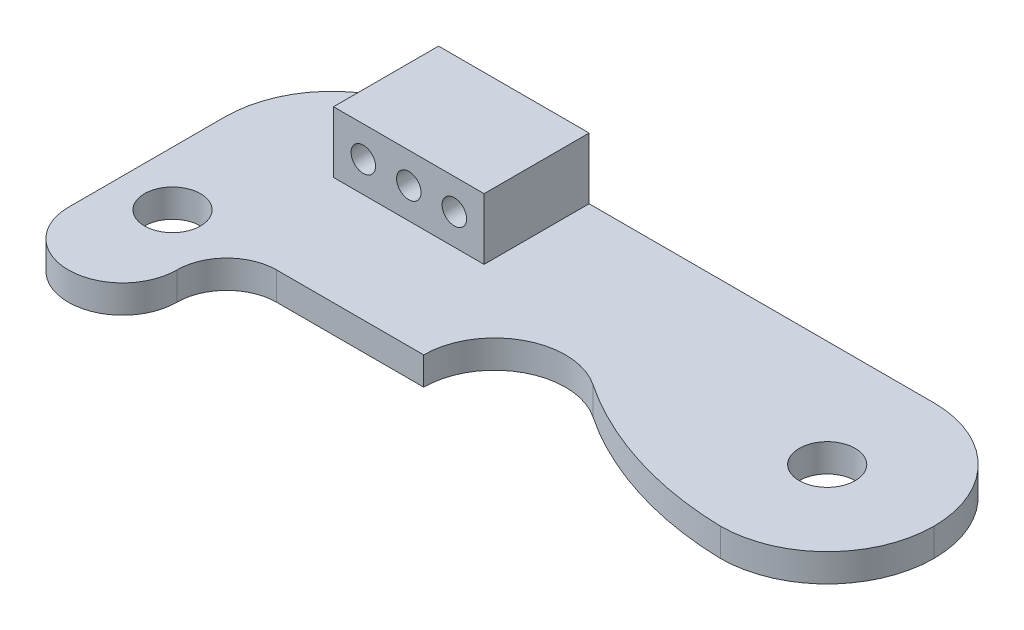
ISO-10303-21;
HEADER;
FILE_DESCRIPTION(('STEP AP214'),'2;1');
FILE_NAME('part.step','',(''),(''),'','','');
FILE_SCHEMA(('AUTOMOTIVE_DESIGN { 1 0 10303 214 1 1 1 1 }'));
ENDSEC;
DATA;
#1=APPLICATION_CONTEXT('core data for automotive mechanical design processes');
#2=APPLICATION_PROTOCOL_DEFINITION('international standard','automotive_design',2000,#1);
#3=PRODUCT_CONTEXT('',#1,'mechanical');
#4=PRODUCT('Part','Part','',(#3));
#5=PRODUCT_RELATED_PRODUCT_CATEGORY('part','',(#4));
#6=PRODUCT_DEFINITION_FORMATION('','',#4);
#7=PRODUCT_DEFINITION_CONTEXT('part definition',#1,'design');
#8=PRODUCT_DEFINITION('design','',#6,#7);
#9=PRODUCT_DEFINITION_SHAPE('','',#8);
#10=(LENGTH_UNIT() NAMED_UNIT(*) SI_UNIT(.MILLI.,.METRE.));
#11=(NAMED_UNIT(*) PLANE_ANGLE_UNIT() SI_UNIT($,.RADIAN.));
#12=(NAMED_UNIT(*) SI_UNIT($,.STERADIAN.) SOLID_ANGLE_UNIT());
#13=UNCERTAINTY_MEASURE_WITH_UNIT(LENGTH_MEASURE(1.E-05),#10,'distance_accuracy_value','');
#14=(GEOMETRIC_REPRESENTATION_CONTEXT(3) GLOBAL_UNCERTAINTY_ASSIGNED_CONTEXT((#13)) GLOBAL_UNIT_ASSIGNED_CONTEXT((#10,
#11,#12)) REPRESENTATION_CONTEXT('',''));
#15=CARTESIAN_POINT('',(0.,0.,0.));
#16=DIRECTION('',(0.,0.,1.));
#17=DIRECTION('',(1.,0.,0.));
#18=AXIS2_PLACEMENT_3D('',#15,#16,#17);
#19=CARTESIAN_POINT('',(1.66623907545329E-13,1.6,188.802493771732));
#20=DIRECTION('',(0.,0.,-1.));
#21=DIRECTION('',(-1.,0.,0.));
#22=AXIS2_PLACEMENT_3D('',#19,#20,#21);
#23=PLANE('',#22);
#24=DIRECTION('',(1.,0.,0.));
#25=VECTOR('',#24,1.);
#26=CARTESIAN_POINT('',(1.66623907545329E-13,0.,188.802493771732));
#27=LINE('',#26,#25);
#28=CARTESIAN_POINT('',(41.9031347015806,0.,188.802493771732));
#29=VERTEX_POINT('',#28);
#30=CARTESIAN_POINT('',(50.3031347015806,0.,188.802493771732));
#31=VERTEX_POINT('',#30);
#32=EDGE_CURVE('E207',#29,#31,#27,.T.);
#33=ORIENTED_EDGE('',*,*,#32,.T.);
#34=DIRECTION('',(0.,1.,0.));
#35=VECTOR('',#34,1.);
#36=CARTESIAN_POINT('',(50.3031347015806,0.,188.802493771732));
#37=LINE('',#36,#35);
#38=CARTESIAN_POINT('',(50.3031347015806,1.6,188.802493771732));
#39=VERTEX_POINT('',#38);
#40=EDGE_CURVE('E174',#31,#39,#37,.T.);
#41=ORIENTED_EDGE('',*,*,#40,.T.);
#42=DIRECTION('',(1.,0.,0.));
#43=VECTOR('',#42,1.);
#44=CARTESIAN_POINT('',(1.66623907545329E-13,1.6,188.802493771732));
#45=LINE('',#44,#43);
#46=CARTESIAN_POINT('',(41.9031347015806,1.6,188.802493771732));
#47=VERTEX_POINT('',#46);
#48=EDGE_CURVE('E194',#47,#39,#45,.T.);
#49=ORIENTED_EDGE('',*,*,#48,.F.);
#50=DIRECTION('',(0.,-1.,0.));
#51=VECTOR('',#50,1.);
#52=CARTESIAN_POINT('',(41.9031347015806,1.6,188.802493771732));
#53=LINE('',#52,#51);
#54=EDGE_CURVE('E199',#47,#29,#53,.T.);
#55=ORIENTED_EDGE('',*,*,#54,.T.);
#56=EDGE_LOOP('',(#33,#41,#49,#55));
#57=FACE_BOUND('',#56,.T.);
#58=ADVANCED_FACE('F37',(#57),#23,.F.);
#59=CARTESIAN_POINT('',(32.8531347015806,1.6,0.));
#60=DIRECTION('',(1.,0.,0.));
#61=DIRECTION('',(0.,0.,-1.));
#62=AXIS2_PLACEMENT_3D('',#59,#60,#61);
#63=PLANE('',#62);
#64=DIRECTION('',(0.,0.,1.));
#65=VECTOR('',#64,1.);
#66=CARTESIAN_POINT('',(32.8531347015806,1.6,0.));
#67=LINE('',#66,#65);
#68=CARTESIAN_POINT('',(32.8531347015806,1.6,182.702493771732));
#69=VERTEX_POINT('',#68);
#70=CARTESIAN_POINT('',(32.8531347015806,1.6,191.652493771732));
#71=VERTEX_POINT('',#70);
#72=EDGE_CURVE('E186',#69,#71,#67,.T.);
#73=ORIENTED_EDGE('',*,*,#72,.F.);
#74=DIRECTION('',(0.,-1.,0.));
#75=VECTOR('',#74,1.);
#76=CARTESIAN_POINT('',(32.8531347015806,0.,182.702493771732));
#77=LINE('',#76,#75);
#78=CARTESIAN_POINT('',(32.8531347015806,0.,182.702493771732));
#79=VERTEX_POINT('',#78);
#80=EDGE_CURVE('E218',#69,#79,#77,.T.);
#81=ORIENTED_EDGE('',*,*,#80,.T.);
#82=DIRECTION('',(0.,0.,1.));
#83=VECTOR('',#82,1.);
#84=CARTESIAN_POINT('',(32.8531347015806,0.,0.));
#85=LINE('',#84,#83);
#86=CARTESIAN_POINT('',(32.8531347015806,0.,191.652493771732));
#87=VERTEX_POINT('',#86);
#88=EDGE_CURVE('E170',#79,#87,#85,.T.);
#89=ORIENTED_EDGE('',*,*,#88,.T.);
#90=DIRECTION('',(0.,-1.,0.));
#91=VECTOR('',#90,1.);
#92=CARTESIAN_POINT('',(32.8531347015806,1.6,191.652493771732));
#93=LINE('',#92,#91);
#94=EDGE_CURVE('E215',#71,#87,#93,.T.);
#95=ORIENTED_EDGE('',*,*,#94,.F.);
#96=EDGE_LOOP('',(#73,#81,#89,#95));
#97=FACE_BOUND('',#96,.T.);
#98=ADVANCED_FACE('F274',(#97),#63,.F.);
#99=CARTESIAN_POINT('',(35.9531347015806,1.6,191.652493771732));
#100=DIRECTION('',(0.,-1.,0.));
#101=DIRECTION('',(0.,0.,-1.));
#102=AXIS2_PLACEMENT_3D('',#99,#100,#101);
#103=CYLINDRICAL_SURFACE('',#102,3.1);
#104=CARTESIAN_POINT('',(35.9531347015806,0.,191.652493771732));
#105=DIRECTION('',(0.,1.,0.));
#106=DIRECTION('',(0.,0.,1.));
#107=AXIS2_PLACEMENT_3D('',#104,#105,#106);
#108=CIRCLE('',#107,3.1);
#109=CARTESIAN_POINT('',(39.0531347015806,0.,191.652493771732));
#110=VERTEX_POINT('',#109);
#111=EDGE_CURVE('E201',#87,#110,#108,.T.);
#112=ORIENTED_EDGE('',*,*,#111,.T.);
#113=DIRECTION('',(0.,-1.,0.));
#114=VECTOR('',#113,1.);
#115=CARTESIAN_POINT('',(39.0531347015806,1.6,191.652493771732));
#116=LINE('',#115,#114);
#117=CARTESIAN_POINT('',(39.0531347015806,1.6,191.652493771732));
#118=VERTEX_POINT('',#117);
#119=EDGE_CURVE('E213',#118,#110,#116,.T.);
#120=ORIENTED_EDGE('',*,*,#119,.F.);
#121=CARTESIAN_POINT('',(35.9531347015806,1.6,191.652493771732));
#122=DIRECTION('',(0.,1.,0.));
#123=DIRECTION('',(0.,0.,1.));
#124=AXIS2_PLACEMENT_3D('',#121,#122,#123);
#125=CIRCLE('',#124,3.1);
#126=EDGE_CURVE('E188',#71,#118,#125,.T.);
#127=ORIENTED_EDGE('',*,*,#126,.F.);
#128=ORIENTED_EDGE('',*,*,#94,.T.);
#129=EDGE_LOOP('',(#112,#120,#127,#128));
#130=FACE_BOUND('',#129,.T.);
#131=ADVANCED_FACE('F268',(#130),#103,.T.);
#132=CARTESIAN_POINT('',(41.9031347015806,1.6,191.652493771732));
#133=DIRECTION('',(0.,-1.,0.));
#134=DIRECTION('',(0.,0.,-1.));
#135=AXIS2_PLACEMENT_3D('',#132,#133,#134);
#136=CYLINDRICAL_SURFACE('',#135,2.85000000000001);
#137=CARTESIAN_POINT('',(41.9031347015806,0.,191.652493771732));
#138=DIRECTION('',(0.,1.,0.));
#139=DIRECTION('',(0.,0.,1.));
#140=AXIS2_PLACEMENT_3D('',#137,#138,#139);
#141=CIRCLE('',#140,2.85000000000001);
#142=EDGE_CURVE('E204',#29,#110,#141,.T.);
#143=ORIENTED_EDGE('',*,*,#142,.F.);
#144=ORIENTED_EDGE('',*,*,#54,.F.);
#145=CARTESIAN_POINT('',(41.9031347015806,1.6,191.652493771732));
#146=DIRECTION('',(0.,1.,0.));
#147=DIRECTION('',(0.,0.,1.));
#148=AXIS2_PLACEMENT_3D('',#145,#146,#147);
#149=CIRCLE('',#148,2.85000000000001);
#150=EDGE_CURVE('E191',#47,#118,#149,.T.);
#151=ORIENTED_EDGE('',*,*,#150,.T.);
#152=ORIENTED_EDGE('',*,*,#119,.T.);
#153=EDGE_LOOP('',(#143,#144,#151,#152));
#154=FACE_BOUND('',#153,.T.);
#155=ADVANCED_FACE('F262',(#154),#136,.F.);
#156=CARTESIAN_POINT('',(0.,1.6,176.602493771732));
#157=DIRECTION('',(0.,0.,-1.));
#158=DIRECTION('',(-1.,0.,0.));
#159=AXIS2_PLACEMENT_3D('',#156,#157,#158);
#160=PLANE('',#159);
#161=CARTESIAN_POINT('',(45.8531347015806,3.35,176.602493771732));
#162=DIRECTION('',(0.,0.,-1.));
#163=DIRECTION('',(-1.,0.,0.));
#164=AXIS2_PLACEMENT_3D('',#161,#162,#163);
#165=CIRCLE('',#164,0.700000000000001);
#166=CARTESIAN_POINT('',(45.1531347015806,3.35,176.602493771732));
#167=VERTEX_POINT('',#166);
#168=EDGE_CURVE('E311',#167,#167,#165,.T.);
#169=ORIENTED_EDGE('',*,*,#168,.F.);
#170=EDGE_LOOP('',(#169));
#171=FACE_BOUND('',#170,.T.);
#172=CARTESIAN_POINT('',(40.6531347015806,3.35,176.602493771732));
#173=DIRECTION('',(0.,0.,-1.));
#174=DIRECTION('',(-1.,0.,0.));
#175=AXIS2_PLACEMENT_3D('',#172,#173,#174);
#176=CIRCLE('',#175,0.700000000000001);
#177=CARTESIAN_POINT('',(39.9531347015806,3.35,176.602493771732));
#178=VERTEX_POINT('',#177);
#179=EDGE_CURVE('E304',#178,#178,#176,.T.);
#180=ORIENTED_EDGE('',*,*,#179,.F.);
#181=EDGE_LOOP('',(#180));
#182=FACE_BOUND('',#181,.T.);
#183=CARTESIAN_POINT('',(43.2531347015806,3.35,176.602493771732));
#184=DIRECTION('',(0.,0.,-1.));
#185=DIRECTION('',(-1.,0.,0.));
#186=AXIS2_PLACEMENT_3D('',#183,#184,#185);
#187=CIRCLE('',#186,0.700000000000001);
#188=CARTESIAN_POINT('',(42.5531347015806,3.35,176.602493771732));
#189=VERTEX_POINT('',#188);
#190=EDGE_CURVE('E305',#189,#189,#187,.T.);
#191=ORIENTED_EDGE('',*,*,#190,.F.);
#192=EDGE_LOOP('',(#191));
#193=FACE_BOUND('',#192,.T.);
#194=DIRECTION('',(1.,0.,0.));
#195=VECTOR('',#194,1.);
#196=CARTESIAN_POINT('',(0.,0.,176.602493771732));
#197=LINE('',#196,#195);
#198=CARTESIAN_POINT('',(38.9531347015806,0.,176.602493771732));
#199=VERTEX_POINT('',#198);
#200=CARTESIAN_POINT('',(67.2531347015806,0.,176.602493771732));
#201=VERTEX_POINT('',#200);
#202=EDGE_CURVE('E189',#199,#201,#197,.T.);
#203=ORIENTED_EDGE('',*,*,#202,.F.);
#204=DIRECTION('',(0.,-1.,0.));
#205=VECTOR('',#204,1.);
#206=CARTESIAN_POINT('',(38.9531347015806,1.6,176.602493771732));
#207=LINE('',#206,#205);
#208=CARTESIAN_POINT('',(38.9531347015806,1.6,176.602493771732));
#209=VERTEX_POINT('',#208);
#210=EDGE_CURVE('E229',#199,#209,#207,.F.);
#211=ORIENTED_EDGE('',*,*,#210,.T.);
#212=DIRECTION('',(0.,-1.,0.));
#213=VECTOR('',#212,1.);
#214=CARTESIAN_POINT('',(38.9531347015806,5.1,176.602493771732));
#215=LINE('',#214,#213);
#216=CARTESIAN_POINT('',(38.9531347015806,5.1,176.602493771732));
#217=VERTEX_POINT('',#216);
#218=EDGE_CURVE('E282',#217,#209,#215,.T.);
#219=ORIENTED_EDGE('',*,*,#218,.F.);
#220=DIRECTION('',(-1.,0.,0.));
#221=VECTOR('',#220,1.);
#222=CARTESIAN_POINT('',(38.9531347015806,5.1,176.602493771732));
#223=LINE('',#222,#221);
#224=CARTESIAN_POINT('',(47.5531347015806,5.1,176.602493771732));
#225=VERTEX_POINT('',#224);
#226=EDGE_CURVE('E150',#225,#217,#223,.T.);
#227=ORIENTED_EDGE('',*,*,#226,.F.);
#228=DIRECTION('',(0.,-1.,0.));
#229=VECTOR('',#228,1.);
#230=CARTESIAN_POINT('',(47.5531347015806,5.1,176.602493771732));
#231=LINE('',#230,#229);
#232=CARTESIAN_POINT('',(47.5531347015806,1.6,176.602493771732));
#233=VERTEX_POINT('',#232);
#234=EDGE_CURVE('E163',#225,#233,#231,.T.);
#235=ORIENTED_EDGE('',*,*,#234,.T.);
#236=DIRECTION('',(1.,0.,0.));
#237=VECTOR('',#236,1.);
#238=CARTESIAN_POINT('',(0.,1.6,176.602493771732));
#239=LINE('',#238,#237);
#240=CARTESIAN_POINT('',(67.2531347015806,1.6,176.602493771732));
#241=VERTEX_POINT('',#240);
#242=EDGE_CURVE('E197',#233,#241,#239,.T.);
#243=ORIENTED_EDGE('',*,*,#242,.T.);
#244=DIRECTION('',(0.,-1.,0.));
#245=VECTOR('',#244,1.);
#246=CARTESIAN_POINT('',(67.2531347015806,1.6,176.602493771732));
#247=LINE('',#246,#245);
#248=EDGE_CURVE('E227',#241,#201,#247,.T.);
#249=ORIENTED_EDGE('',*,*,#248,.T.);
#250=EDGE_LOOP('',(#203,#211,#219,#227,#235,#243,#249));
#251=FACE_BOUND('',#250,.T.);
#252=ADVANCED_FACE('F281',(#171,#182,#193,#251),#160,.T.);
#253=CARTESIAN_POINT('',(0.,1.6,0.));
#254=DIRECTION('',(0.,1.,0.));
#255=DIRECTION('',(0.,0.,1.));
#256=AXIS2_PLACEMENT_3D('',#253,#254,#255);
#257=PLANE('',#256);
#258=CARTESIAN_POINT('',(54.3531347015806,1.6,188.802493771732));
#259=DIRECTION('',(0.,1.,0.));
#260=DIRECTION('',(0.,0.,1.));
#261=AXIS2_PLACEMENT_3D('',#258,#259,#260);
#262=CIRCLE('',#261,4.05);
#263=CARTESIAN_POINT('',(56.6037602152875,1.6,185.435420146601));
#264=VERTEX_POINT('',#263);
#265=EDGE_CURVE('E177',#264,#39,#262,.T.);
#266=ORIENTED_EDGE('',*,*,#265,.F.);
#267=CARTESIAN_POINT('',(67.7179602829759,1.6,168.807896071881));
#268=DIRECTION('',(0.,1.,0.));
#269=DIRECTION('',(0.,0.,1.));
#270=AXIS2_PLACEMENT_3D('',#267,#268,#269);
#271=CIRCLE('',#270,20.);
#272=CARTESIAN_POINT('',(67.2531347015806,1.6,188.802493771732));
#273=VERTEX_POINT('',#272);
#274=EDGE_CURVE('E45',#264,#273,#271,.T.);
#275=ORIENTED_EDGE('',*,*,#274,.T.);
#276=CARTESIAN_POINT('',(67.2531347015806,1.6,182.702493771732));
#277=DIRECTION('',(0.,1.,0.));
#278=DIRECTION('',(0.,0.,1.));
#279=AXIS2_PLACEMENT_3D('',#276,#277,#278);
#280=CIRCLE('',#279,6.1);
#281=CARTESIAN_POINT('',(73.3531347015806,1.6,182.702493771732));
#282=VERTEX_POINT('',#281);
#283=EDGE_CURVE('E235',#273,#282,#280,.T.);
#284=ORIENTED_EDGE('',*,*,#283,.T.);
#285=CARTESIAN_POINT('',(67.2531347015806,1.6,182.702493771732));
#286=DIRECTION('',(0.,1.,0.));
#287=DIRECTION('',(0.,0.,1.));
#288=AXIS2_PLACEMENT_3D('',#285,#286,#287);
#289=CIRCLE('',#288,6.1);
#290=EDGE_CURVE('E232',#282,#241,#289,.T.);
#291=ORIENTED_EDGE('',*,*,#290,.T.);
#292=ORIENTED_EDGE('',*,*,#242,.F.);
#293=DIRECTION('',(0.,0.,-1.));
#294=VECTOR('',#293,1.);
#295=CARTESIAN_POINT('',(47.5531347015806,1.6,176.602493771732));
#296=LINE('',#295,#294);
#297=CARTESIAN_POINT('',(47.5531347015806,1.6,182.602493771732));
#298=VERTEX_POINT('',#297);
#299=EDGE_CURVE('E154',#298,#233,#296,.T.);
#300=ORIENTED_EDGE('',*,*,#299,.F.);
#301=DIRECTION('',(1.,0.,0.));
#302=VECTOR('',#301,1.);
#303=CARTESIAN_POINT('',(38.9531347015806,1.6,182.602493771732));
#304=LINE('',#303,#302);
#305=CARTESIAN_POINT('',(38.9531347015806,1.6,182.602493771732));
#306=VERTEX_POINT('',#305);
#307=EDGE_CURVE('E292',#306,#298,#304,.T.);
#308=ORIENTED_EDGE('',*,*,#307,.F.);
#309=DIRECTION('',(0.,0.,1.));
#310=VECTOR('',#309,1.);
#311=CARTESIAN_POINT('',(38.9531347015806,1.6,176.602493771732));
#312=LINE('',#311,#310);
#313=EDGE_CURVE('E157',#209,#306,#312,.T.);
#314=ORIENTED_EDGE('',*,*,#313,.F.);
#315=CARTESIAN_POINT('',(38.9531347015806,1.6,182.702493771732));
#316=DIRECTION('',(0.,1.,0.));
#317=DIRECTION('',(0.,0.,1.));
#318=AXIS2_PLACEMENT_3D('',#315,#316,#317);
#319=CIRCLE('',#318,6.1);
#320=EDGE_CURVE('E237',#209,#69,#319,.T.);
#321=ORIENTED_EDGE('',*,*,#320,.T.);
#322=ORIENTED_EDGE('',*,*,#72,.T.);
#323=ORIENTED_EDGE('',*,*,#126,.T.);
#324=ORIENTED_EDGE('',*,*,#150,.F.);
#325=ORIENTED_EDGE('',*,*,#48,.T.);
#326=EDGE_LOOP('',(#266,#275,#284,#291,#292,#300,#308,#314,#321,#322,#323,#324,#325));
#327=FACE_BOUND('',#326,.T.);
#328=CARTESIAN_POINT('',(67.2531347015806,1.6,182.702493771732));
#329=DIRECTION('',(0.,1.,0.));
#330=DIRECTION('',(0.,0.,1.));
#331=AXIS2_PLACEMENT_3D('',#328,#329,#330);
#332=CIRCLE('',#331,1.6);
#333=CARTESIAN_POINT('',(67.2531347015806,1.6,184.302493771732));
#334=VERTEX_POINT('',#333);
#335=EDGE_CURVE('E171',#334,#334,#332,.T.);
#336=ORIENTED_EDGE('',*,*,#335,.F.);
#337=EDGE_LOOP('',(#336));
#338=FACE_BOUND('',#337,.T.);
#339=CARTESIAN_POINT('',(35.9531347015806,1.6,188.802493771732));
#340=DIRECTION('',(0.,1.,0.));
#341=DIRECTION('',(0.,0.,1.));
#342=AXIS2_PLACEMENT_3D('',#339,#340,#341);
#343=CIRCLE('',#342,1.6);
#344=CARTESIAN_POINT('',(35.9531347015806,1.6,190.402493771732));
#345=VERTEX_POINT('',#344);
#346=EDGE_CURVE('E161',#345,#345,#343,.T.);
#347=ORIENTED_EDGE('',*,*,#346,.F.);
#348=EDGE_LOOP('',(#347));
#349=FACE_BOUND('',#348,.T.);
#350=ADVANCED_FACE('F245',(#327,#338,#349),#257,.T.);
#351=CARTESIAN_POINT('',(0.,0.,0.));
#352=DIRECTION('',(0.,1.,0.));
#353=DIRECTION('',(0.,0.,1.));
#354=AXIS2_PLACEMENT_3D('',#351,#352,#353);
#355=PLANE('',#354);
#356=CARTESIAN_POINT('',(67.2531347015806,0.,182.702493771732));
#357=DIRECTION('',(0.,1.,0.));
#358=DIRECTION('',(0.,0.,1.));
#359=AXIS2_PLACEMENT_3D('',#356,#357,#358);
#360=CIRCLE('',#359,1.6);
#361=CARTESIAN_POINT('',(67.2531347015806,0.,184.302493771732));
#362=VERTEX_POINT('',#361);
#363=EDGE_CURVE('E167',#362,#362,#360,.T.);
#364=ORIENTED_EDGE('',*,*,#363,.T.);
#365=EDGE_LOOP('',(#364));
#366=FACE_BOUND('',#365,.T.);
#367=CARTESIAN_POINT('',(35.9531347015806,0.,188.802493771732));
#368=DIRECTION('',(0.,1.,0.));
#369=DIRECTION('',(0.,0.,1.));
#370=AXIS2_PLACEMENT_3D('',#367,#368,#369);
#371=CIRCLE('',#370,1.6);
#372=CARTESIAN_POINT('',(35.9531347015806,0.,190.402493771732));
#373=VERTEX_POINT('',#372);
#374=EDGE_CURVE('E179',#373,#373,#371,.T.);
#375=ORIENTED_EDGE('',*,*,#374,.T.);
#376=EDGE_LOOP('',(#375));
#377=FACE_BOUND('',#376,.T.);
#378=CARTESIAN_POINT('',(67.2531347015806,0.,182.702493771732));
#379=DIRECTION('',(0.,1.,0.));
#380=DIRECTION('',(0.,0.,1.));
#381=AXIS2_PLACEMENT_3D('',#378,#379,#380);
#382=CIRCLE('',#381,6.1);
#383=CARTESIAN_POINT('',(73.3531347015806,0.,182.702493771732));
#384=VERTEX_POINT('',#383);
#385=CARTESIAN_POINT('',(67.2531347015806,0.,188.802493771732));
#386=VERTEX_POINT('',#385);
#387=EDGE_CURVE('E223',#384,#386,#382,.F.);
#388=ORIENTED_EDGE('',*,*,#387,.T.);
#389=CARTESIAN_POINT('',(67.7179602829759,0.,168.807896071881));
#390=DIRECTION('',(0.,1.,0.));
#391=DIRECTION('',(0.,0.,1.));
#392=AXIS2_PLACEMENT_3D('',#389,#390,#391);
#393=CIRCLE('',#392,20.);
#394=CARTESIAN_POINT('',(56.6037602152875,0.,185.435420146601));
#395=VERTEX_POINT('',#394);
#396=EDGE_CURVE('E11',#386,#395,#393,.F.);
#397=ORIENTED_EDGE('',*,*,#396,.T.);
#398=CARTESIAN_POINT('',(54.3531347015806,0.,188.802493771732));
#399=DIRECTION('',(0.,1.,0.));
#400=DIRECTION('',(0.,0.,1.));
#401=AXIS2_PLACEMENT_3D('',#398,#399,#400);
#402=CIRCLE('',#401,4.05);
#403=EDGE_CURVE('E175',#395,#31,#402,.T.);
#404=ORIENTED_EDGE('',*,*,#403,.T.);
#405=ORIENTED_EDGE('',*,*,#32,.F.);
#406=ORIENTED_EDGE('',*,*,#142,.T.);
#407=ORIENTED_EDGE('',*,*,#111,.F.);
#408=ORIENTED_EDGE('',*,*,#88,.F.);
#409=CARTESIAN_POINT('',(38.9531347015806,0.,182.702493771732));
#410=DIRECTION('',(0.,1.,0.));
#411=DIRECTION('',(0.,0.,1.));
#412=AXIS2_PLACEMENT_3D('',#409,#410,#411);
#413=CIRCLE('',#412,6.1);
#414=EDGE_CURVE('E225',#79,#199,#413,.F.);
#415=ORIENTED_EDGE('',*,*,#414,.T.);
#416=ORIENTED_EDGE('',*,*,#202,.T.);
#417=CARTESIAN_POINT('',(67.2531347015806,0.,182.702493771732));
#418=DIRECTION('',(0.,1.,0.));
#419=DIRECTION('',(0.,0.,1.));
#420=AXIS2_PLACEMENT_3D('',#417,#418,#419);
#421=CIRCLE('',#420,6.1);
#422=EDGE_CURVE('E221',#201,#384,#421,.F.);
#423=ORIENTED_EDGE('',*,*,#422,.T.);
#424=EDGE_LOOP('',(#388,#397,#404,#405,#406,#407,#408,#415,#416,#423));
#425=FACE_BOUND('',#424,.T.);
#426=ADVANCED_FACE('F257',(#366,#377,#425),#355,.F.);
#427=CARTESIAN_POINT('',(35.9531347015806,0.,188.802493771732));
#428=DIRECTION('',(0.,1.,0.));
#429=DIRECTION('',(0.,0.,1.));
#430=AXIS2_PLACEMENT_3D('',#427,#428,#429);
#431=CYLINDRICAL_SURFACE('',#430,1.6);
#432=ORIENTED_EDGE('',*,*,#374,.F.);
#433=EDGE_LOOP('',(#432));
#434=FACE_BOUND('',#433,.T.);
#435=ORIENTED_EDGE('',*,*,#346,.T.);
#436=EDGE_LOOP('',(#435));
#437=FACE_BOUND('',#436,.T.);
#438=ADVANCED_FACE('F448',(#434,#437),#431,.F.);
#439=CARTESIAN_POINT('',(54.3531347015806,0.,188.802493771732));
#440=DIRECTION('',(0.,1.,0.));
#441=DIRECTION('',(0.,0.,1.));
#442=AXIS2_PLACEMENT_3D('',#439,#440,#441);
#443=CYLINDRICAL_SURFACE('',#442,4.05);
#444=ORIENTED_EDGE('',*,*,#403,.F.);
#445=DIRECTION('',(0.,1.,0.));
#446=VECTOR('',#445,1.);
#447=CARTESIAN_POINT('',(56.6037602152875,0.,185.435420146601));
#448=LINE('',#447,#446);
#449=EDGE_CURVE('E240',#395,#264,#448,.T.);
#450=ORIENTED_EDGE('',*,*,#449,.T.);
#451=ORIENTED_EDGE('',*,*,#265,.T.);
#452=ORIENTED_EDGE('',*,*,#40,.F.);
#453=EDGE_LOOP('',(#444,#450,#451,#452));
#454=FACE_BOUND('',#453,.T.);
#455=ADVANCED_FACE('F254',(#454),#443,.F.);
#456=CARTESIAN_POINT('',(67.2531347015806,0.,182.702493771732));
#457=DIRECTION('',(0.,1.,0.));
#458=DIRECTION('',(0.,0.,1.));
#459=AXIS2_PLACEMENT_3D('',#456,#457,#458);
#460=CYLINDRICAL_SURFACE('',#459,1.6);
#461=ORIENTED_EDGE('',*,*,#363,.F.);
#462=EDGE_LOOP('',(#461));
#463=FACE_BOUND('',#462,.T.);
#464=ORIENTED_EDGE('',*,*,#335,.T.);
#465=EDGE_LOOP('',(#464));
#466=FACE_BOUND('',#465,.T.);
#467=ADVANCED_FACE('F361',(#463,#466),#460,.F.);
#468=CARTESIAN_POINT('',(38.9531347015806,1.6,182.702493771732));
#469=DIRECTION('',(0.,1.,0.));
#470=DIRECTION('',(0.,0.,1.));
#471=AXIS2_PLACEMENT_3D('',#468,#469,#470);
#472=CYLINDRICAL_SURFACE('',#471,6.1);
#473=ORIENTED_EDGE('',*,*,#320,.F.);
#474=ORIENTED_EDGE('',*,*,#210,.F.);
#475=ORIENTED_EDGE('',*,*,#414,.F.);
#476=ORIENTED_EDGE('',*,*,#80,.F.);
#477=EDGE_LOOP('',(#473,#474,#475,#476));
#478=FACE_BOUND('',#477,.T.);
#479=ADVANCED_FACE('F278',(#478),#472,.T.);
#480=CARTESIAN_POINT('',(67.2531347015806,1.6,182.702493771732));
#481=DIRECTION('',(0.,-1.,0.));
#482=DIRECTION('',(0.,0.,-1.));
#483=AXIS2_PLACEMENT_3D('',#480,#481,#482);
#484=CYLINDRICAL_SURFACE('',#483,6.1);
#485=ORIENTED_EDGE('',*,*,#248,.F.);
#486=ORIENTED_EDGE('',*,*,#290,.F.);
#487=DIRECTION('',(0.,-1.,0.));
#488=VECTOR('',#487,1.);
#489=CARTESIAN_POINT('',(73.3531347015806,1.6,182.702493771732));
#490=LINE('',#489,#488);
#491=EDGE_CURVE('E158',#384,#282,#490,.F.);
#492=ORIENTED_EDGE('',*,*,#491,.F.);
#493=ORIENTED_EDGE('',*,*,#422,.F.);
#494=EDGE_LOOP('',(#485,#486,#492,#493));
#495=FACE_BOUND('',#494,.T.);
#496=ADVANCED_FACE('F286',(#495),#484,.T.);
#497=CARTESIAN_POINT('',(67.2531347015806,1.6,182.702493771732));
#498=DIRECTION('',(0.,1.,0.));
#499=DIRECTION('',(0.,0.,1.));
#500=AXIS2_PLACEMENT_3D('',#497,#498,#499);
#501=CYLINDRICAL_SURFACE('',#500,6.1);
#502=ORIENTED_EDGE('',*,*,#283,.F.);
#503=DIRECTION('',(0.,-1.,0.));
#504=VECTOR('',#503,1.);
#505=CARTESIAN_POINT('',(67.2531347015806,1.6,188.802493771732));
#506=LINE('',#505,#504);
#507=EDGE_CURVE('E239',#386,#273,#506,.F.);
#508=ORIENTED_EDGE('',*,*,#507,.F.);
#509=ORIENTED_EDGE('',*,*,#387,.F.);
#510=ORIENTED_EDGE('',*,*,#491,.T.);
#511=EDGE_LOOP('',(#502,#508,#509,#510));
#512=FACE_BOUND('',#511,.T.);
#513=ADVANCED_FACE('F250',(#512),#501,.T.);
#514=CARTESIAN_POINT('',(38.9531347015806,5.1,176.602493771732));
#515=DIRECTION('',(1.,0.,0.));
#516=DIRECTION('',(0.,0.,-1.));
#517=AXIS2_PLACEMENT_3D('',#514,#515,#516);
#518=PLANE('',#517);
#519=ORIENTED_EDGE('',*,*,#313,.T.);
#520=DIRECTION('',(0.,-1.,0.));
#521=VECTOR('',#520,1.);
#522=CARTESIAN_POINT('',(38.9531347015806,5.1,182.602493771732));
#523=LINE('',#522,#521);
#524=CARTESIAN_POINT('',(38.9531347015806,5.1,182.602493771732));
#525=VERTEX_POINT('',#524);
#526=EDGE_CURVE('E138',#525,#306,#523,.T.);
#527=ORIENTED_EDGE('',*,*,#526,.F.);
#528=DIRECTION('',(0.,0.,1.));
#529=VECTOR('',#528,1.);
#530=CARTESIAN_POINT('',(38.9531347015806,5.1,176.602493771732));
#531=LINE('',#530,#529);
#532=EDGE_CURVE('E145',#217,#525,#531,.T.);
#533=ORIENTED_EDGE('',*,*,#532,.F.);
#534=ORIENTED_EDGE('',*,*,#218,.T.);
#535=EDGE_LOOP('',(#519,#527,#533,#534));
#536=FACE_BOUND('',#535,.T.);
#537=ADVANCED_FACE('F156',(#536),#518,.F.);
#538=CARTESIAN_POINT('',(38.9531347015806,5.1,182.602493771732));
#539=DIRECTION('',(0.,0.,-1.));
#540=DIRECTION('',(-1.,0.,0.));
#541=AXIS2_PLACEMENT_3D('',#538,#539,#540);
#542=PLANE('',#541);
#543=CARTESIAN_POINT('',(45.8531347015806,3.35,182.602493771732));
#544=DIRECTION('',(0.,0.,-1.));
#545=DIRECTION('',(-1.,0.,0.));
#546=AXIS2_PLACEMENT_3D('',#543,#544,#545);
#547=CIRCLE('',#546,0.700000000000001);
#548=CARTESIAN_POINT('',(45.1531347015806,3.35,182.602493771732));
#549=VERTEX_POINT('',#548);
#550=EDGE_CURVE('E298',#549,#549,#547,.F.);
#551=ORIENTED_EDGE('',*,*,#550,.F.);
#552=EDGE_LOOP('',(#551));
#553=FACE_BOUND('',#552,.T.);
#554=CARTESIAN_POINT('',(40.6531347015806,3.35,182.602493771732));
#555=DIRECTION('',(0.,0.,-1.));
#556=DIRECTION('',(-1.,0.,0.));
#557=AXIS2_PLACEMENT_3D('',#554,#555,#556);
#558=CIRCLE('',#557,0.700000000000001);
#559=CARTESIAN_POINT('',(39.9531347015806,3.35,182.602493771732));
#560=VERTEX_POINT('',#559);
#561=EDGE_CURVE('E308',#560,#560,#558,.F.);
#562=ORIENTED_EDGE('',*,*,#561,.F.);
#563=EDGE_LOOP('',(#562));
#564=FACE_BOUND('',#563,.T.);
#565=CARTESIAN_POINT('',(43.2531347015806,3.35,182.602493771732));
#566=DIRECTION('',(0.,0.,-1.));
#567=DIRECTION('',(-1.,0.,0.));
#568=AXIS2_PLACEMENT_3D('',#565,#566,#567);
#569=CIRCLE('',#568,0.700000000000001);
#570=CARTESIAN_POINT('',(42.5531347015806,3.35,182.602493771732));
#571=VERTEX_POINT('',#570);
#572=EDGE_CURVE('E301',#571,#571,#569,.F.);
#573=ORIENTED_EDGE('',*,*,#572,.F.);
#574=EDGE_LOOP('',(#573));
#575=FACE_BOUND('',#574,.T.);
#576=ORIENTED_EDGE('',*,*,#307,.T.);
#577=DIRECTION('',(0.,-1.,0.));
#578=VECTOR('',#577,1.);
#579=CARTESIAN_POINT('',(47.5531347015806,5.1,182.602493771732));
#580=LINE('',#579,#578);
#581=CARTESIAN_POINT('',(47.5531347015806,5.1,182.602493771732));
#582=VERTEX_POINT('',#581);
#583=EDGE_CURVE('E141',#582,#298,#580,.T.);
#584=ORIENTED_EDGE('',*,*,#583,.F.);
#585=DIRECTION('',(1.,0.,0.));
#586=VECTOR('',#585,1.);
#587=CARTESIAN_POINT('',(38.9531347015806,5.1,182.602493771732));
#588=LINE('',#587,#586);
#589=EDGE_CURVE('E133',#525,#582,#588,.T.);
#590=ORIENTED_EDGE('',*,*,#589,.F.);
#591=ORIENTED_EDGE('',*,*,#526,.T.);
#592=EDGE_LOOP('',(#576,#584,#590,#591));
#593=FACE_BOUND('',#592,.T.);
#594=ADVANCED_FACE('F136',(#553,#564,#575,#593),#542,.F.);
#595=CARTESIAN_POINT('',(47.5531347015806,5.1,176.602493771732));
#596=DIRECTION('',(-1.,0.,0.));
#597=DIRECTION('',(0.,0.,1.));
#598=AXIS2_PLACEMENT_3D('',#595,#596,#597);
#599=PLANE('',#598);
#600=ORIENTED_EDGE('',*,*,#299,.T.);
#601=ORIENTED_EDGE('',*,*,#234,.F.);
#602=DIRECTION('',(0.,0.,-1.));
#603=VECTOR('',#602,1.);
#604=CARTESIAN_POINT('',(47.5531347015806,5.1,176.602493771732));
#605=LINE('',#604,#603);
#606=EDGE_CURVE('E144',#582,#225,#605,.T.);
#607=ORIENTED_EDGE('',*,*,#606,.F.);
#608=ORIENTED_EDGE('',*,*,#583,.T.);
#609=EDGE_LOOP('',(#600,#601,#607,#608));
#610=FACE_BOUND('',#609,.T.);
#611=ADVANCED_FACE('F291',(#610),#599,.F.);
#612=CARTESIAN_POINT('',(0.,5.1,0.));
#613=DIRECTION('',(0.,1.,0.));
#614=DIRECTION('',(0.,0.,1.));
#615=AXIS2_PLACEMENT_3D('',#612,#613,#614);
#616=PLANE('',#615);
#617=ORIENTED_EDGE('',*,*,#532,.T.);
#618=ORIENTED_EDGE('',*,*,#589,.T.);
#619=ORIENTED_EDGE('',*,*,#606,.T.);
#620=ORIENTED_EDGE('',*,*,#226,.T.);
#621=EDGE_LOOP('',(#617,#618,#619,#620));
#622=FACE_BOUND('',#621,.T.);
#623=ADVANCED_FACE('F148',(#622),#616,.T.);
#624=CARTESIAN_POINT('',(43.2531347015806,3.35,194.753493771732));
#625=DIRECTION('',(0.,0.,-1.));
#626=DIRECTION('',(-1.,0.,0.));
#627=AXIS2_PLACEMENT_3D('',#624,#625,#626);
#628=CYLINDRICAL_SURFACE('',#627,0.700000000000001);
#629=ORIENTED_EDGE('',*,*,#190,.T.);
#630=EDGE_LOOP('',(#629));
#631=FACE_BOUND('',#630,.T.);
#632=ORIENTED_EDGE('',*,*,#572,.T.);
#633=EDGE_LOOP('',(#632));
#634=FACE_BOUND('',#633,.T.);
#635=ADVANCED_FACE('F329',(#631,#634),#628,.F.);
#636=CARTESIAN_POINT('',(40.6531347015806,3.35,194.753493771732));
#637=DIRECTION('',(0.,0.,-1.));
#638=DIRECTION('',(-1.,0.,0.));
#639=AXIS2_PLACEMENT_3D('',#636,#637,#638);
#640=CYLINDRICAL_SURFACE('',#639,0.700000000000001);
#641=ORIENTED_EDGE('',*,*,#179,.T.);
#642=EDGE_LOOP('',(#641));
#643=FACE_BOUND('',#642,.T.);
#644=ORIENTED_EDGE('',*,*,#561,.T.);
#645=EDGE_LOOP('',(#644));
#646=FACE_BOUND('',#645,.T.);
#647=ADVANCED_FACE('F332',(#643,#646),#640,.F.);
#648=CARTESIAN_POINT('',(45.8531347015806,3.35,194.753493771732));
#649=DIRECTION('',(0.,0.,-1.));
#650=DIRECTION('',(-1.,0.,0.));
#651=AXIS2_PLACEMENT_3D('',#648,#649,#650);
#652=CYLINDRICAL_SURFACE('',#651,0.700000000000001);
#653=ORIENTED_EDGE('',*,*,#168,.T.);
#654=EDGE_LOOP('',(#653));
#655=FACE_BOUND('',#654,.T.);
#656=ORIENTED_EDGE('',*,*,#550,.T.);
#657=EDGE_LOOP('',(#656));
#658=FACE_BOUND('',#657,.T.);
#659=ADVANCED_FACE('F319',(#655,#658),#652,.F.);
#660=CARTESIAN_POINT('',(67.7179602829759,1.6,168.807896071881));
#661=DIRECTION('',(0.,1.,0.));
#662=DIRECTION('',(0.,0.,1.));
#663=AXIS2_PLACEMENT_3D('',#660,#661,#662);
#664=CYLINDRICAL_SURFACE('',#663,20.);
#665=ORIENTED_EDGE('',*,*,#396,.F.);
#666=ORIENTED_EDGE('',*,*,#507,.T.);
#667=ORIENTED_EDGE('',*,*,#274,.F.);
#668=ORIENTED_EDGE('',*,*,#449,.F.);
#669=EDGE_LOOP('',(#665,#666,#667,#668));
#670=FACE_BOUND('',#669,.T.);
#671=ADVANCED_FACE('F39',(#670),#664,.T.);
#672=CLOSED_SHELL('',(#58,#98,#131,#155,#252,#350,#426,#438,#455,#467,#479,#496,#513,#537,#594,
#611,#623,#635,#647,#659,#671));
#673=MANIFOLD_SOLID_BREP('B2',#672);
#674=ADVANCED_BREP_SHAPE_REPRESENTATION('',(#18,#673),#14);
#675=SHAPE_DEFINITION_REPRESENTATION(#9,#674);
ENDSEC;
END-ISO-10303-21;
